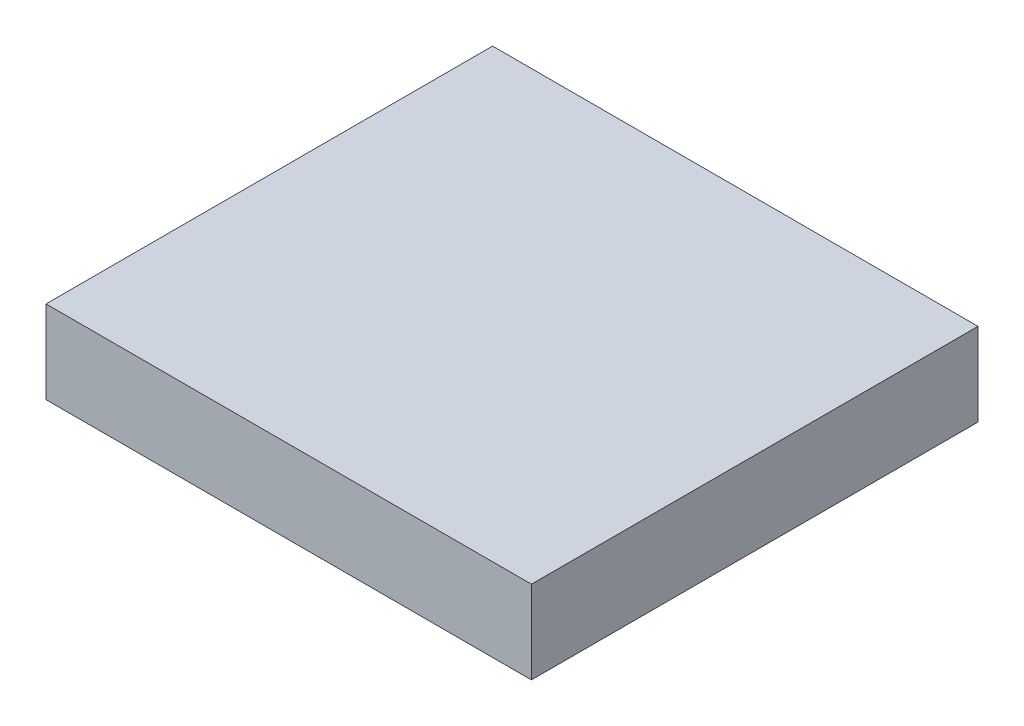
ISO-10303-21;
HEADER;
FILE_DESCRIPTION(('STEP AP214'),'2;1');
FILE_NAME('part.step','',(''),(''),'','','');
FILE_SCHEMA(('AUTOMOTIVE_DESIGN { 1 0 10303 214 1 1 1 1 }'));
ENDSEC;
DATA;
#1=APPLICATION_CONTEXT('core data for automotive mechanical design processes');
#2=APPLICATION_PROTOCOL_DEFINITION('international standard','automotive_design',2000,#1);
#3=PRODUCT_CONTEXT('',#1,'mechanical');
#4=PRODUCT('Part','Part','',(#3));
#5=PRODUCT_RELATED_PRODUCT_CATEGORY('part','',(#4));
#6=PRODUCT_DEFINITION_FORMATION('','',#4);
#7=PRODUCT_DEFINITION_CONTEXT('part definition',#1,'design');
#8=PRODUCT_DEFINITION('design','',#6,#7);
#9=PRODUCT_DEFINITION_SHAPE('','',#8);
#10=(LENGTH_UNIT() NAMED_UNIT(*) SI_UNIT(.MILLI.,.METRE.));
#11=(NAMED_UNIT(*) PLANE_ANGLE_UNIT() SI_UNIT($,.RADIAN.));
#12=(NAMED_UNIT(*) SI_UNIT($,.STERADIAN.) SOLID_ANGLE_UNIT());
#13=UNCERTAINTY_MEASURE_WITH_UNIT(LENGTH_MEASURE(1.E-05),#10,'distance_accuracy_value','');
#14=(GEOMETRIC_REPRESENTATION_CONTEXT(3) GLOBAL_UNCERTAINTY_ASSIGNED_CONTEXT((#13)) GLOBAL_UNIT_ASSIGNED_CONTEXT((#10,
#11,#12)) REPRESENTATION_CONTEXT('',''));
#15=CARTESIAN_POINT('',(0.,0.,0.));
#16=DIRECTION('',(0.,0.,1.));
#17=DIRECTION('',(1.,0.,0.));
#18=AXIS2_PLACEMENT_3D('',#15,#16,#17);
#19=CARTESIAN_POINT('',(0.,0.,0.));
#20=DIRECTION('',(0.,1.,0.));
#21=DIRECTION('',(0.,0.,1.));
#22=AXIS2_PLACEMENT_3D('',#19,#20,#21);
#23=PLANE('',#22);
#24=DIRECTION('',(0.,0.,1.));
#25=VECTOR('',#24,1.);
#26=CARTESIAN_POINT('',(-15.875,0.,-14.605));
#27=LINE('',#26,#25);
#28=CARTESIAN_POINT('',(-15.875,0.,-14.605));
#29=VERTEX_POINT('',#28);
#30=CARTESIAN_POINT('',(-15.875,0.,14.605));
#31=VERTEX_POINT('',#30);
#32=EDGE_CURVE('E114',#29,#31,#27,.T.);
#33=ORIENTED_EDGE('',*,*,#32,.F.);
#34=DIRECTION('',(-1.,0.,0.));
#35=VECTOR('',#34,1.);
#36=CARTESIAN_POINT('',(-15.875,0.,-14.605));
#37=LINE('',#36,#35);
#38=CARTESIAN_POINT('',(15.875,0.,-14.605));
#39=VERTEX_POINT('',#38);
#40=EDGE_CURVE('E82',#39,#29,#37,.T.);
#41=ORIENTED_EDGE('',*,*,#40,.F.);
#42=DIRECTION('',(0.,0.,-1.));
#43=VECTOR('',#42,1.);
#44=CARTESIAN_POINT('',(15.875,0.,-14.605));
#45=LINE('',#44,#43);
#46=CARTESIAN_POINT('',(15.875,0.,14.605));
#47=VERTEX_POINT('',#46);
#48=EDGE_CURVE('E130',#47,#39,#45,.T.);
#49=ORIENTED_EDGE('',*,*,#48,.F.);
#50=DIRECTION('',(1.,0.,0.));
#51=VECTOR('',#50,1.);
#52=CARTESIAN_POINT('',(-15.875,0.,14.605));
#53=LINE('',#52,#51);
#54=EDGE_CURVE('E117',#31,#47,#53,.T.);
#55=ORIENTED_EDGE('',*,*,#54,.F.);
#56=EDGE_LOOP('',(#33,#41,#49,#55));
#57=FACE_BOUND('',#56,.T.);
#58=CARTESIAN_POINT('',(0.,0.,0.));
#59=DIRECTION('',(0.,1.,0.));
#60=DIRECTION('',(0.,0.,1.));
#61=AXIS2_PLACEMENT_3D('',#58,#59,#60);
#62=CIRCLE('',#61,13.208);
#63=CARTESIAN_POINT('',(11.96768649322,0.,-5.588));
#64=VERTEX_POINT('',#63);
#65=CARTESIAN_POINT('',(11.96768649322,0.,5.588));
#66=VERTEX_POINT('',#65);
#67=EDGE_CURVE('E52',#64,#66,#62,.T.);
#68=ORIENTED_EDGE('',*,*,#67,.T.);
#69=DIRECTION('',(0.,0.,-1.));
#70=VECTOR('',#69,1.);
#71=CARTESIAN_POINT('',(11.96768649322,0.,-5.588));
#72=LINE('',#71,#70);
#73=EDGE_CURVE('E110',#66,#64,#72,.T.);
#74=ORIENTED_EDGE('',*,*,#73,.T.);
#75=EDGE_LOOP('',(#68,#74));
#76=FACE_BOUND('',#75,.T.);
#77=ADVANCED_FACE('F37',(#57,#76),#23,.F.);
#78=CARTESIAN_POINT('',(-15.875,5.4229,-14.605));
#79=DIRECTION('',(1.,0.,0.));
#80=DIRECTION('',(0.,0.,-1.));
#81=AXIS2_PLACEMENT_3D('',#78,#79,#80);
#82=PLANE('',#81);
#83=ORIENTED_EDGE('',*,*,#32,.T.);
#84=DIRECTION('',(0.,-1.,0.));
#85=VECTOR('',#84,1.);
#86=CARTESIAN_POINT('',(-15.875,5.4229,14.605));
#87=LINE('',#86,#85);
#88=CARTESIAN_POINT('',(-15.875,5.4229,14.605));
#89=VERTEX_POINT('',#88);
#90=EDGE_CURVE('E11',#89,#31,#87,.T.);
#91=ORIENTED_EDGE('',*,*,#90,.F.);
#92=DIRECTION('',(0.,0.,1.));
#93=VECTOR('',#92,1.);
#94=CARTESIAN_POINT('',(-15.875,5.4229,-14.605));
#95=LINE('',#94,#93);
#96=CARTESIAN_POINT('',(-15.875,5.4229,-14.605));
#97=VERTEX_POINT('',#96);
#98=EDGE_CURVE('E122',#97,#89,#95,.T.);
#99=ORIENTED_EDGE('',*,*,#98,.F.);
#100=DIRECTION('',(0.,-1.,0.));
#101=VECTOR('',#100,1.);
#102=CARTESIAN_POINT('',(-15.875,5.4229,-14.605));
#103=LINE('',#102,#101);
#104=EDGE_CURVE('E127',#97,#29,#103,.T.);
#105=ORIENTED_EDGE('',*,*,#104,.T.);
#106=EDGE_LOOP('',(#83,#91,#99,#105));
#107=FACE_BOUND('',#106,.T.);
#108=ADVANCED_FACE('F39',(#107),#82,.F.);
#109=CARTESIAN_POINT('',(-15.875,5.4229,14.605));
#110=DIRECTION('',(0.,0.,-1.));
#111=DIRECTION('',(-1.,0.,0.));
#112=AXIS2_PLACEMENT_3D('',#109,#110,#111);
#113=PLANE('',#112);
#114=ORIENTED_EDGE('',*,*,#54,.T.);
#115=DIRECTION('',(0.,-1.,0.));
#116=VECTOR('',#115,1.);
#117=CARTESIAN_POINT('',(15.875,5.4229,14.605));
#118=LINE('',#117,#116);
#119=CARTESIAN_POINT('',(15.875,5.4229,14.605));
#120=VERTEX_POINT('',#119);
#121=EDGE_CURVE('E45',#120,#47,#118,.T.);
#122=ORIENTED_EDGE('',*,*,#121,.F.);
#123=DIRECTION('',(1.,0.,0.));
#124=VECTOR('',#123,1.);
#125=CARTESIAN_POINT('',(-15.875,5.4229,14.605));
#126=LINE('',#125,#124);
#127=EDGE_CURVE('E89',#89,#120,#126,.T.);
#128=ORIENTED_EDGE('',*,*,#127,.F.);
#129=ORIENTED_EDGE('',*,*,#90,.T.);
#130=EDGE_LOOP('',(#114,#122,#128,#129));
#131=FACE_BOUND('',#130,.T.);
#132=ADVANCED_FACE('F156',(#131),#113,.F.);
#133=CARTESIAN_POINT('',(15.875,5.4229,-14.605));
#134=DIRECTION('',(-1.,0.,0.));
#135=DIRECTION('',(0.,0.,1.));
#136=AXIS2_PLACEMENT_3D('',#133,#134,#135);
#137=PLANE('',#136);
#138=ORIENTED_EDGE('',*,*,#48,.T.);
#139=DIRECTION('',(0.,-1.,0.));
#140=VECTOR('',#139,1.);
#141=CARTESIAN_POINT('',(15.875,5.4229,-14.605));
#142=LINE('',#141,#140);
#143=CARTESIAN_POINT('',(15.875,5.4229,-14.605));
#144=VERTEX_POINT('',#143);
#145=EDGE_CURVE('E134',#144,#39,#142,.T.);
#146=ORIENTED_EDGE('',*,*,#145,.F.);
#147=DIRECTION('',(0.,0.,-1.));
#148=VECTOR('',#147,1.);
#149=CARTESIAN_POINT('',(15.875,5.4229,-14.605));
#150=LINE('',#149,#148);
#151=EDGE_CURVE('E125',#120,#144,#150,.T.);
#152=ORIENTED_EDGE('',*,*,#151,.F.);
#153=ORIENTED_EDGE('',*,*,#121,.T.);
#154=EDGE_LOOP('',(#138,#146,#152,#153));
#155=FACE_BOUND('',#154,.T.);
#156=ADVANCED_FACE('F139',(#155),#137,.F.);
#157=CARTESIAN_POINT('',(-15.875,5.4229,-14.605));
#158=DIRECTION('',(0.,0.,1.));
#159=DIRECTION('',(1.,0.,0.));
#160=AXIS2_PLACEMENT_3D('',#157,#158,#159);
#161=PLANE('',#160);
#162=ORIENTED_EDGE('',*,*,#40,.T.);
#163=ORIENTED_EDGE('',*,*,#104,.F.);
#164=DIRECTION('',(-1.,0.,0.));
#165=VECTOR('',#164,1.);
#166=CARTESIAN_POINT('',(-15.875,5.4229,-14.605));
#167=LINE('',#166,#165);
#168=EDGE_CURVE('E61',#144,#97,#167,.T.);
#169=ORIENTED_EDGE('',*,*,#168,.F.);
#170=ORIENTED_EDGE('',*,*,#145,.T.);
#171=EDGE_LOOP('',(#162,#163,#169,#170));
#172=FACE_BOUND('',#171,.T.);
#173=ADVANCED_FACE('F147',(#172),#161,.F.);
#174=CARTESIAN_POINT('',(0.,5.4229,0.));
#175=DIRECTION('',(0.,1.,0.));
#176=DIRECTION('',(0.,0.,1.));
#177=AXIS2_PLACEMENT_3D('',#174,#175,#176);
#178=PLANE('',#177);
#179=ORIENTED_EDGE('',*,*,#98,.T.);
#180=ORIENTED_EDGE('',*,*,#127,.T.);
#181=ORIENTED_EDGE('',*,*,#151,.T.);
#182=ORIENTED_EDGE('',*,*,#168,.T.);
#183=EDGE_LOOP('',(#179,#180,#181,#182));
#184=FACE_BOUND('',#183,.T.);
#185=ADVANCED_FACE('F149',(#184),#178,.T.);
#186=CARTESIAN_POINT('',(0.,0.8636,0.));
#187=DIRECTION('',(0.,-1.,0.));
#188=DIRECTION('',(0.,0.,-1.));
#189=AXIS2_PLACEMENT_3D('',#186,#187,#188);
#190=CYLINDRICAL_SURFACE('',#189,13.208);
#191=ORIENTED_EDGE('',*,*,#67,.F.);
#192=DIRECTION('',(0.,-1.,0.));
#193=VECTOR('',#192,1.);
#194=CARTESIAN_POINT('',(11.96768649322,0.8636,-5.588));
#195=LINE('',#194,#193);
#196=CARTESIAN_POINT('',(11.96768649322,0.8636,-5.588));
#197=VERTEX_POINT('',#196);
#198=EDGE_CURVE('E106',#197,#64,#195,.T.);
#199=ORIENTED_EDGE('',*,*,#198,.F.);
#200=CARTESIAN_POINT('',(0.,0.8636,0.));
#201=DIRECTION('',(0.,1.,0.));
#202=DIRECTION('',(0.,0.,1.));
#203=AXIS2_PLACEMENT_3D('',#200,#201,#202);
#204=CIRCLE('',#203,13.208);
#205=CARTESIAN_POINT('',(11.96768649322,0.8636,5.588));
#206=VERTEX_POINT('',#205);
#207=EDGE_CURVE('E103',#197,#206,#204,.T.);
#208=ORIENTED_EDGE('',*,*,#207,.T.);
#209=DIRECTION('',(0.,-1.,0.));
#210=VECTOR('',#209,1.);
#211=CARTESIAN_POINT('',(11.96768649322,0.8636,5.588));
#212=LINE('',#211,#210);
#213=EDGE_CURVE('E109',#206,#66,#212,.T.);
#214=ORIENTED_EDGE('',*,*,#213,.T.);
#215=EDGE_LOOP('',(#191,#199,#208,#214));
#216=FACE_BOUND('',#215,.T.);
#217=ADVANCED_FACE('F108',(#216),#190,.F.);
#218=CARTESIAN_POINT('',(11.96768649322,0.8636,-5.588));
#219=DIRECTION('',(-1.,0.,0.));
#220=DIRECTION('',(0.,0.,1.));
#221=AXIS2_PLACEMENT_3D('',#218,#219,#220);
#222=PLANE('',#221);
#223=ORIENTED_EDGE('',*,*,#73,.F.);
#224=ORIENTED_EDGE('',*,*,#213,.F.);
#225=DIRECTION('',(0.,0.,-1.));
#226=VECTOR('',#225,1.);
#227=CARTESIAN_POINT('',(11.96768649322,0.8636,-5.588));
#228=LINE('',#227,#226);
#229=EDGE_CURVE('E100',#206,#197,#228,.T.);
#230=ORIENTED_EDGE('',*,*,#229,.T.);
#231=ORIENTED_EDGE('',*,*,#198,.T.);
#232=EDGE_LOOP('',(#223,#224,#230,#231));
#233=FACE_BOUND('',#232,.T.);
#234=ADVANCED_FACE('F112',(#233),#222,.T.);
#235=CARTESIAN_POINT('',(0.,0.8636,0.));
#236=DIRECTION('',(0.,1.,0.));
#237=DIRECTION('',(0.,0.,1.));
#238=AXIS2_PLACEMENT_3D('',#235,#236,#237);
#239=PLANE('',#238);
#240=ORIENTED_EDGE('',*,*,#207,.F.);
#241=ORIENTED_EDGE('',*,*,#229,.F.);
#242=EDGE_LOOP('',(#240,#241));
#243=FACE_BOUND('',#242,.T.);
#244=ADVANCED_FACE('F102',(#243),#239,.F.);
#245=CLOSED_SHELL('',(#77,#108,#132,#156,#173,#185,#217,#234,#244));
#246=MANIFOLD_SOLID_BREP('B2',#245);
#247=ADVANCED_BREP_SHAPE_REPRESENTATION('',(#18,#246),#14);
#248=SHAPE_DEFINITION_REPRESENTATION(#9,#247);
ENDSEC;
END-ISO-10303-21;
